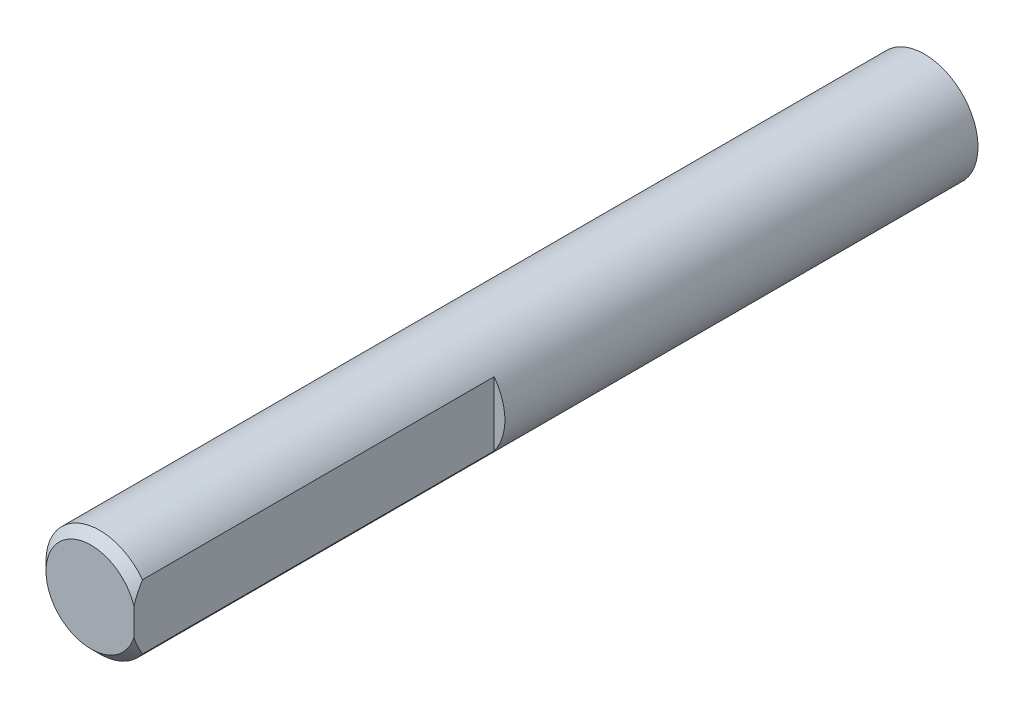
ISO-10303-21;
HEADER;
FILE_DESCRIPTION(('STEP AP214'),'2;1');
FILE_NAME('part.step','',(''),(''),'','','');
FILE_SCHEMA(('AUTOMOTIVE_DESIGN { 1 0 10303 214 1 1 1 1 }'));
ENDSEC;
DATA;
#1=APPLICATION_CONTEXT('core data for automotive mechanical design processes');
#2=APPLICATION_PROTOCOL_DEFINITION('international standard','automotive_design',2000,#1);
#3=PRODUCT_CONTEXT('',#1,'mechanical');
#4=PRODUCT('Part','Part','',(#3));
#5=PRODUCT_RELATED_PRODUCT_CATEGORY('part','',(#4));
#6=PRODUCT_DEFINITION_FORMATION('','',#4);
#7=PRODUCT_DEFINITION_CONTEXT('part definition',#1,'design');
#8=PRODUCT_DEFINITION('design','',#6,#7);
#9=PRODUCT_DEFINITION_SHAPE('','',#8);
#10=(LENGTH_UNIT() NAMED_UNIT(*) SI_UNIT(.MILLI.,.METRE.));
#11=(NAMED_UNIT(*) PLANE_ANGLE_UNIT() SI_UNIT($,.RADIAN.));
#12=(NAMED_UNIT(*) SI_UNIT($,.STERADIAN.) SOLID_ANGLE_UNIT());
#13=UNCERTAINTY_MEASURE_WITH_UNIT(LENGTH_MEASURE(1.E-05),#10,'distance_accuracy_value','');
#14=(GEOMETRIC_REPRESENTATION_CONTEXT(3) GLOBAL_UNCERTAINTY_ASSIGNED_CONTEXT((#13)) GLOBAL_UNIT_ASSIGNED_CONTEXT((#10,
#11,#12)) REPRESENTATION_CONTEXT('',''));
#15=CARTESIAN_POINT('',(0.,0.,0.));
#16=DIRECTION('',(0.,0.,1.));
#17=DIRECTION('',(1.,0.,0.));
#18=AXIS2_PLACEMENT_3D('',#15,#16,#17);
#19=CARTESIAN_POINT('',(2.01,-2.01,1.25));
#20=DIRECTION('',(0.,0.,-1.));
#21=DIRECTION('',(-1.,0.,0.));
#22=AXIS2_PLACEMENT_3D('',#19,#20,#21);
#23=PLANE('',#22);
#24=CARTESIAN_POINT('',(0.,0.,1.25000000002728));
#25=DIRECTION('',(0.,0.,1.));
#26=DIRECTION('',(1.,0.,0.));
#27=AXIS2_PLACEMENT_3D('',#24,#25,#26);
#28=CIRCLE('',#27,2.00000000000955);
#29=CARTESIAN_POINT('',(2.00000000000955,0.,1.25000000002728));
#30=VERTEX_POINT('',#29);
#31=EDGE_CURVE('E57',#30,#30,#28,.T.);
#32=ORIENTED_EDGE('',*,*,#31,.F.);
#33=EDGE_LOOP('',(#32));
#34=FACE_BOUND('',#33,.T.);
#35=ADVANCED_FACE('F17',(#34),#23,.T.);
#36=CARTESIAN_POINT('',(-2.11,-2.36220818209992,40.2500033378601));
#37=DIRECTION('',(0.,0.,1.));
#38=DIRECTION('',(0.,-1.,0.));
#39=AXIS2_PLACEMENT_3D('',#36,#37,#38);
#40=PLANE('',#39);
#41=CARTESIAN_POINT('',(0.,1.16285019807761E-13,40.2500033378601));
#42=DIRECTION('',(0.,0.,-1.));
#43=DIRECTION('',(-1.,0.,0.));
#44=AXIS2_PLACEMENT_3D('',#41,#42,#43);
#45=CIRCLE('',#44,2.09999999998445);
#46=CARTESIAN_POINT('',(2.00000002980232,-0.640312330605365,40.2500033378601));
#47=VERTEX_POINT('',#46);
#48=CARTESIAN_POINT('',(2.00000002980232,0.640312330605597,40.2500033378601));
#49=VERTEX_POINT('',#48);
#50=EDGE_CURVE('E156',#47,#49,#45,.T.);
#51=ORIENTED_EDGE('',*,*,#50,.F.);
#52=DIRECTION('',(0.,-1.,0.));
#53=VECTOR('',#52,1.);
#54=CARTESIAN_POINT('',(2.00000002980232,-2.36220818209992,40.2500033378601));
#55=LINE('',#54,#53);
#56=EDGE_CURVE('E58',#47,#49,#55,.F.);
#57=ORIENTED_EDGE('',*,*,#56,.T.);
#58=EDGE_LOOP('',(#51,#57));
#59=FACE_BOUND('',#58,.T.);
#60=ADVANCED_FACE('F97',(#59),#40,.T.);
#61=CARTESIAN_POINT('',(1.99000002980232,-1.50999996026357,23.4500033378601));
#62=DIRECTION('',(0.,0.,1.));
#63=DIRECTION('',(1.,0.,0.));
#64=AXIS2_PLACEMENT_3D('',#61,#62,#63);
#65=PLANE('',#64);
#66=DIRECTION('',(0.,1.,0.));
#67=VECTOR('',#66,1.);
#68=CARTESIAN_POINT('',(2.00000002980232,1.50999996026358,23.4500033378601));
#69=LINE('',#68,#67);
#70=CARTESIAN_POINT('',(2.00000002980232,-1.49999996026357,23.4500033378601));
#71=VERTEX_POINT('',#70);
#72=CARTESIAN_POINT('',(2.00000002980229,1.49999996026361,23.4500033378601));
#73=VERTEX_POINT('',#72);
#74=EDGE_CURVE('E59',#71,#73,#69,.T.);
#75=ORIENTED_EDGE('',*,*,#74,.F.);
#76=CARTESIAN_POINT('',(0.,0.,23.4500033378601));
#77=DIRECTION('',(0.,0.,-1.));
#78=DIRECTION('',(-1.,0.,0.));
#79=AXIS2_PLACEMENT_3D('',#76,#77,#78);
#80=CIRCLE('',#79,2.5);
#81=EDGE_CURVE('E20',#71,#73,#80,.F.);
#82=ORIENTED_EDGE('',*,*,#81,.T.);
#83=EDGE_LOOP('',(#75,#82));
#84=FACE_BOUND('',#83,.T.);
#85=ADVANCED_FACE('F60',(#84),#65,.T.);
#86=CARTESIAN_POINT('',(0.,0.,1.38397459622297));
#87=DIRECTION('',(0.,0.,1.));
#88=DIRECTION('',(1.,0.,0.));
#89=AXIS2_PLACEMENT_3D('',#86,#87,#88);
#90=CONICAL_SURFACE('',#89,2.49999999994088,1.3089969389985);
#91=ORIENTED_EDGE('',*,*,#31,.T.);
#92=EDGE_LOOP('',(#91));
#93=FACE_BOUND('',#92,.T.);
#94=CARTESIAN_POINT('',(0.,0.,1.38397459621556));
#95=DIRECTION('',(0.,0.,-1.));
#96=DIRECTION('',(-1.,0.,0.));
#97=AXIS2_PLACEMENT_3D('',#94,#95,#96);
#98=CIRCLE('',#97,2.5);
#99=CARTESIAN_POINT('',(-2.5,0.,1.38397459621556));
#100=VERTEX_POINT('',#99);
#101=EDGE_CURVE('E64',#100,#100,#98,.F.);
#102=ORIENTED_EDGE('',*,*,#101,.F.);
#103=EDGE_LOOP('',(#102));
#104=FACE_BOUND('',#103,.T.);
#105=ADVANCED_FACE('F90',(#93,#104),#90,.T.);
#106=CARTESIAN_POINT('',(0.,1.16285019807761E-13,39.8500033379037));
#107=DIRECTION('',(0.,0.,-1.));
#108=DIRECTION('',(-1.,0.,0.));
#109=AXIS2_PLACEMENT_3D('',#106,#107,#108);
#110=CONICAL_SURFACE('',#109,2.49999999994088,0.785398163397448);
#111=CARTESIAN_POINT('',(2.00000002980564,1.49999996025771,39.8500033378502));
#112=CARTESIAN_POINT('',(2.00000002980352,1.43199495418267,39.8907697080514));
#113=CARTESIAN_POINT('',(2.00000002980264,1.36320574175172,39.930302498811));
#114=CARTESIAN_POINT('',(2.000000029802,1.22407102940034,40.0058819868064));
#115=CARTESIAN_POINT('',(2.00000002980223,1.15373212139581,40.0419408738748));
#116=CARTESIAN_POINT('',(2.00000002980241,1.01094378596743,40.1098988885477));
#117=CARTESIAN_POINT('',(2.00000002980237,0.938492252446329,40.1417936785126));
#118=CARTESIAN_POINT('',(2.00000002980227,0.791179157390642,40.2002589155967));
#119=CARTESIAN_POINT('',(2.00000002980223,0.7163097223884,40.2268093794496));
#120=CARTESIAN_POINT('',(2.00000002980232,0.640312330651372,40.2500033378461));
#121=B_SPLINE_CURVE_WITH_KNOTS('',3,(#111,#112,#113,#114,#115,#116,#117,#118,#119,#120),
.UNSPECIFIED.,.F.,.F.,(4,2,2,2,4),(0.,0.237905186203779,0.474942593825463,0.712224980330192,
0.950378762666505),.UNSPECIFIED.);
#122=CARTESIAN_POINT('',(2.00000002980229,1.49999996026023,39.8500033378544));
#123=VERTEX_POINT('',#122);
#124=EDGE_CURVE('E61',#123,#49,#121,.T.);
#125=ORIENTED_EDGE('',*,*,#124,.F.);
#126=CARTESIAN_POINT('',(0.,0.,39.8500033378601));
#127=DIRECTION('',(0.,0.,-1.));
#128=DIRECTION('',(-1.,0.,0.));
#129=AXIS2_PLACEMENT_3D('',#126,#127,#128);
#130=CIRCLE('',#129,2.5);
#131=CARTESIAN_POINT('',(2.00000002980232,-1.49999996026011,39.8500033378544));
#132=VERTEX_POINT('',#131);
#133=EDGE_CURVE('E26',#132,#123,#130,.T.);
#134=ORIENTED_EDGE('',*,*,#133,.F.);
#135=CARTESIAN_POINT('',(2.00000002980232,-0.640312330651159,40.2500033378461));
#136=CARTESIAN_POINT('',(2.00000002980232,-0.716309722388245,40.2268093794496));
#137=CARTESIAN_POINT('',(2.00000002980232,-0.791179157390508,40.2002589155967));
#138=CARTESIAN_POINT('',(2.00000002980232,-0.93849225244622,40.1417936785125));
#139=CARTESIAN_POINT('',(2.00000002980232,-1.01094378596733,40.1098988885476));
#140=CARTESIAN_POINT('',(2.00000002980232,-1.15373212139581,40.0419408738747));
#141=CARTESIAN_POINT('',(2.00000002980232,-1.22407102940043,40.0058819868064));
#142=CARTESIAN_POINT('',(2.00000002980232,-1.36320574175172,39.9303024988107));
#143=CARTESIAN_POINT('',(2.00000002980232,-1.43199495418249,39.8907697080506));
#144=CARTESIAN_POINT('',(2.00000002980232,-1.49999996025702,39.8500033378484));
#145=B_SPLINE_CURVE_WITH_KNOTS('',3,(#135,#136,#137,#138,#139,#140,#141,#142,#143,#144),
.UNSPECIFIED.,.F.,.F.,(4,2,2,2,4),(0.,0.238153782336416,0.475436168841211,0.712473576463021,
0.950378762666967),.UNSPECIFIED.);
#146=EDGE_CURVE('E48',#47,#132,#145,.T.);
#147=ORIENTED_EDGE('',*,*,#146,.F.);
#148=ORIENTED_EDGE('',*,*,#50,.T.);
#149=EDGE_LOOP('',(#125,#134,#147,#148));
#150=FACE_BOUND('',#149,.T.);
#151=ADVANCED_FACE('F86',(#150),#110,.T.);
#152=CARTESIAN_POINT('',(2.00000002980232,1.50999996026358,40.4600033378601));
#153=DIRECTION('',(1.,0.,0.));
#154=DIRECTION('',(0.,0.,-1.));
#155=AXIS2_PLACEMENT_3D('',#152,#153,#154);
#156=PLANE('',#155);
#157=DIRECTION('',(0.,0.,-1.));
#158=VECTOR('',#157,1.);
#159=CARTESIAN_POINT('',(2.00000002980227,1.49999996026364,40.0500033378601));
#160=LINE('',#159,#158);
#161=EDGE_CURVE('E11',#123,#73,#160,.T.);
#162=ORIENTED_EDGE('',*,*,#161,.F.);
#163=ORIENTED_EDGE('',*,*,#124,.T.);
#164=ORIENTED_EDGE('',*,*,#56,.F.);
#165=ORIENTED_EDGE('',*,*,#146,.T.);
#166=DIRECTION('',(0.,0.,-1.));
#167=VECTOR('',#166,1.);
#168=CARTESIAN_POINT('',(2.00000002980232,-1.49999996026357,40.0500033378601));
#169=LINE('',#168,#167);
#170=EDGE_CURVE('E55',#71,#132,#169,.F.);
#171=ORIENTED_EDGE('',*,*,#170,.F.);
#172=ORIENTED_EDGE('',*,*,#74,.T.);
#173=EDGE_LOOP('',(#162,#163,#164,#165,#171,#172));
#174=FACE_BOUND('',#173,.T.);
#175=ADVANCED_FACE('F63',(#174),#156,.T.);
#176=CARTESIAN_POINT('',(0.,0.,40.0500033378601));
#177=DIRECTION('',(0.,0.,-1.));
#178=DIRECTION('',(-1.,0.,0.));
#179=AXIS2_PLACEMENT_3D('',#176,#177,#178);
#180=CYLINDRICAL_SURFACE('',#179,2.5);
#181=ORIENTED_EDGE('',*,*,#81,.F.);
#182=ORIENTED_EDGE('',*,*,#170,.T.);
#183=ORIENTED_EDGE('',*,*,#133,.T.);
#184=ORIENTED_EDGE('',*,*,#161,.T.);
#185=EDGE_LOOP('',(#181,#182,#183,#184));
#186=FACE_BOUND('',#185,.T.);
#187=ORIENTED_EDGE('',*,*,#101,.T.);
#188=EDGE_LOOP('',(#187));
#189=FACE_BOUND('',#188,.T.);
#190=ADVANCED_FACE('F52',(#186,#189),#180,.T.);
#191=CLOSED_SHELL('',(#35,#60,#85,#105,#151,#175,#190));
#192=MANIFOLD_SOLID_BREP('B1',#191);
#193=ADVANCED_BREP_SHAPE_REPRESENTATION('',(#18,#192),#14);
#194=SHAPE_DEFINITION_REPRESENTATION(#9,#193);
ENDSEC;
END-ISO-10303-21;
